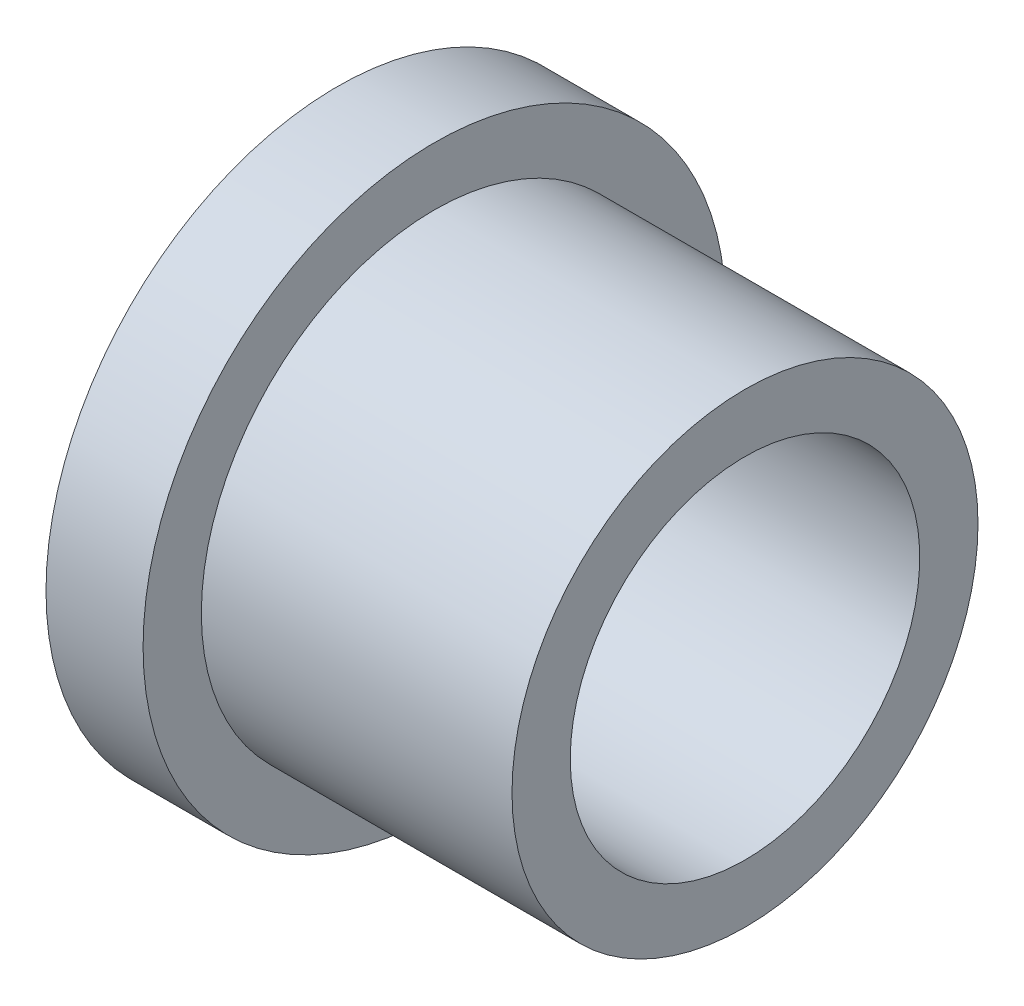
ISO-10303-21;
HEADER;
FILE_DESCRIPTION(('STEP AP214'),'2;1');
FILE_NAME('part.step','',(''),(''),'','','');
FILE_SCHEMA(('AUTOMOTIVE_DESIGN { 1 0 10303 214 1 1 1 1 }'));
ENDSEC;
DATA;
#1=APPLICATION_CONTEXT('core data for automotive mechanical design processes');
#2=APPLICATION_PROTOCOL_DEFINITION('international standard','automotive_design',2000,#1);
#3=PRODUCT_CONTEXT('',#1,'mechanical');
#4=PRODUCT('Part','Part','',(#3));
#5=PRODUCT_RELATED_PRODUCT_CATEGORY('part','',(#4));
#6=PRODUCT_DEFINITION_FORMATION('','',#4);
#7=PRODUCT_DEFINITION_CONTEXT('part definition',#1,'design');
#8=PRODUCT_DEFINITION('design','',#6,#7);
#9=PRODUCT_DEFINITION_SHAPE('','',#8);
#10=(LENGTH_UNIT() NAMED_UNIT(*) SI_UNIT(.MILLI.,.METRE.));
#11=(NAMED_UNIT(*) PLANE_ANGLE_UNIT() SI_UNIT($,.RADIAN.));
#12=(NAMED_UNIT(*) SI_UNIT($,.STERADIAN.) SOLID_ANGLE_UNIT());
#13=UNCERTAINTY_MEASURE_WITH_UNIT(LENGTH_MEASURE(1.E-05),#10,'distance_accuracy_value','');
#14=(GEOMETRIC_REPRESENTATION_CONTEXT(3) GLOBAL_UNCERTAINTY_ASSIGNED_CONTEXT((#13)) GLOBAL_UNIT_ASSIGNED_CONTEXT((#10,
#11,#12)) REPRESENTATION_CONTEXT('',''));
#15=CARTESIAN_POINT('',(0.,0.,0.));
#16=DIRECTION('',(0.,0.,1.));
#17=DIRECTION('',(1.,0.,0.));
#18=AXIS2_PLACEMENT_3D('',#15,#16,#17);
#19=CARTESIAN_POINT('',(0.,0.,0.));
#20=DIRECTION('',(-1.,0.,0.));
#21=DIRECTION('',(0.,0.,1.));
#22=AXIS2_PLACEMENT_3D('',#19,#20,#21);
#23=CYLINDRICAL_SURFACE('',#22,9.);
#24=CARTESIAN_POINT('',(21.,0.,0.));
#25=DIRECTION('',(-1.,0.,0.));
#26=DIRECTION('',(0.,0.,1.));
#27=AXIS2_PLACEMENT_3D('',#24,#25,#26);
#28=CIRCLE('',#27,9.);
#29=CARTESIAN_POINT('',(21.,0.,9.));
#30=VERTEX_POINT('',#29);
#31=EDGE_CURVE('E53',#30,#30,#28,.T.);
#32=ORIENTED_EDGE('',*,*,#31,.F.);
#33=EDGE_LOOP('',(#32));
#34=FACE_BOUND('',#33,.T.);
#35=CARTESIAN_POINT('',(0.,0.,0.));
#36=DIRECTION('',(-1.,0.,0.));
#37=DIRECTION('',(0.,0.,1.));
#38=AXIS2_PLACEMENT_3D('',#35,#36,#37);
#39=CIRCLE('',#38,9.);
#40=CARTESIAN_POINT('',(0.,0.,9.));
#41=VERTEX_POINT('',#40);
#42=EDGE_CURVE('E10',#41,#41,#39,.T.);
#43=ORIENTED_EDGE('',*,*,#42,.T.);
#44=EDGE_LOOP('',(#43));
#45=FACE_BOUND('',#44,.T.);
#46=ADVANCED_FACE('F31',(#34,#45),#23,.F.);
#47=CARTESIAN_POINT('',(0.,9.,0.));
#48=DIRECTION('',(1.,0.,0.));
#49=DIRECTION('',(0.,0.,-1.));
#50=AXIS2_PLACEMENT_3D('',#47,#48,#49);
#51=PLANE('',#50);
#52=ORIENTED_EDGE('',*,*,#42,.F.);
#53=EDGE_LOOP('',(#52));
#54=FACE_BOUND('',#53,.T.);
#55=CARTESIAN_POINT('',(0.,0.,0.));
#56=DIRECTION('',(-1.,0.,0.));
#57=DIRECTION('',(0.,0.,1.));
#58=AXIS2_PLACEMENT_3D('',#55,#56,#57);
#59=CIRCLE('',#58,15.);
#60=CARTESIAN_POINT('',(0.,0.,15.));
#61=VERTEX_POINT('',#60);
#62=EDGE_CURVE('E37',#61,#61,#59,.T.);
#63=ORIENTED_EDGE('',*,*,#62,.T.);
#64=EDGE_LOOP('',(#63));
#65=FACE_BOUND('',#64,.T.);
#66=ADVANCED_FACE('F60',(#54,#65),#51,.F.);
#67=CARTESIAN_POINT('',(0.,0.,0.));
#68=DIRECTION('',(-1.,0.,0.));
#69=DIRECTION('',(0.,0.,1.));
#70=AXIS2_PLACEMENT_3D('',#67,#68,#69);
#71=CYLINDRICAL_SURFACE('',#70,15.);
#72=ORIENTED_EDGE('',*,*,#62,.F.);
#73=EDGE_LOOP('',(#72));
#74=FACE_BOUND('',#73,.T.);
#75=CARTESIAN_POINT('',(5.,0.,0.));
#76=DIRECTION('',(-1.,0.,0.));
#77=DIRECTION('',(0.,0.,1.));
#78=AXIS2_PLACEMENT_3D('',#75,#76,#77);
#79=CIRCLE('',#78,15.);
#80=CARTESIAN_POINT('',(5.,0.,15.));
#81=VERTEX_POINT('',#80);
#82=EDGE_CURVE('E41',#81,#81,#79,.T.);
#83=ORIENTED_EDGE('',*,*,#82,.T.);
#84=EDGE_LOOP('',(#83));
#85=FACE_BOUND('',#84,.T.);
#86=ADVANCED_FACE('F64',(#74,#85),#71,.T.);
#87=CARTESIAN_POINT('',(5.,15.,0.));
#88=DIRECTION('',(-1.,0.,0.));
#89=DIRECTION('',(0.,0.,1.));
#90=AXIS2_PLACEMENT_3D('',#87,#88,#89);
#91=PLANE('',#90);
#92=ORIENTED_EDGE('',*,*,#82,.F.);
#93=EDGE_LOOP('',(#92));
#94=FACE_BOUND('',#93,.T.);
#95=CARTESIAN_POINT('',(5.,0.,0.));
#96=DIRECTION('',(-1.,0.,0.));
#97=DIRECTION('',(0.,0.,1.));
#98=AXIS2_PLACEMENT_3D('',#95,#96,#97);
#99=CIRCLE('',#98,12.);
#100=CARTESIAN_POINT('',(5.,0.,12.));
#101=VERTEX_POINT('',#100);
#102=EDGE_CURVE('E45',#101,#101,#99,.T.);
#103=ORIENTED_EDGE('',*,*,#102,.T.);
#104=EDGE_LOOP('',(#103));
#105=FACE_BOUND('',#104,.T.);
#106=ADVANCED_FACE('F69',(#94,#105),#91,.F.);
#107=CARTESIAN_POINT('',(0.,0.,0.));
#108=DIRECTION('',(-1.,0.,0.));
#109=DIRECTION('',(0.,0.,1.));
#110=AXIS2_PLACEMENT_3D('',#107,#108,#109);
#111=CYLINDRICAL_SURFACE('',#110,12.);
#112=ORIENTED_EDGE('',*,*,#102,.F.);
#113=EDGE_LOOP('',(#112));
#114=FACE_BOUND('',#113,.T.);
#115=CARTESIAN_POINT('',(21.,0.,0.));
#116=DIRECTION('',(-1.,0.,0.));
#117=DIRECTION('',(0.,0.,1.));
#118=AXIS2_PLACEMENT_3D('',#115,#116,#117);
#119=CIRCLE('',#118,12.);
#120=CARTESIAN_POINT('',(21.,0.,12.));
#121=VERTEX_POINT('',#120);
#122=EDGE_CURVE('E50',#121,#121,#119,.T.);
#123=ORIENTED_EDGE('',*,*,#122,.T.);
#124=EDGE_LOOP('',(#123));
#125=FACE_BOUND('',#124,.T.);
#126=ADVANCED_FACE('F75',(#114,#125),#111,.T.);
#127=CARTESIAN_POINT('',(21.,12.,0.));
#128=DIRECTION('',(-1.,0.,0.));
#129=DIRECTION('',(0.,0.,1.));
#130=AXIS2_PLACEMENT_3D('',#127,#128,#129);
#131=PLANE('',#130);
#132=ORIENTED_EDGE('',*,*,#122,.F.);
#133=EDGE_LOOP('',(#132));
#134=FACE_BOUND('',#133,.T.);
#135=ORIENTED_EDGE('',*,*,#31,.T.);
#136=EDGE_LOOP('',(#135));
#137=FACE_BOUND('',#136,.T.);
#138=ADVANCED_FACE('F57',(#134,#137),#131,.F.);
#139=CLOSED_SHELL('',(#46,#66,#86,#106,#126,#138));
#140=MANIFOLD_SOLID_BREP('B2',#139);
#141=ADVANCED_BREP_SHAPE_REPRESENTATION('',(#18,#140),#14);
#142=SHAPE_DEFINITION_REPRESENTATION(#9,#141);
ENDSEC;
END-ISO-10303-21;
